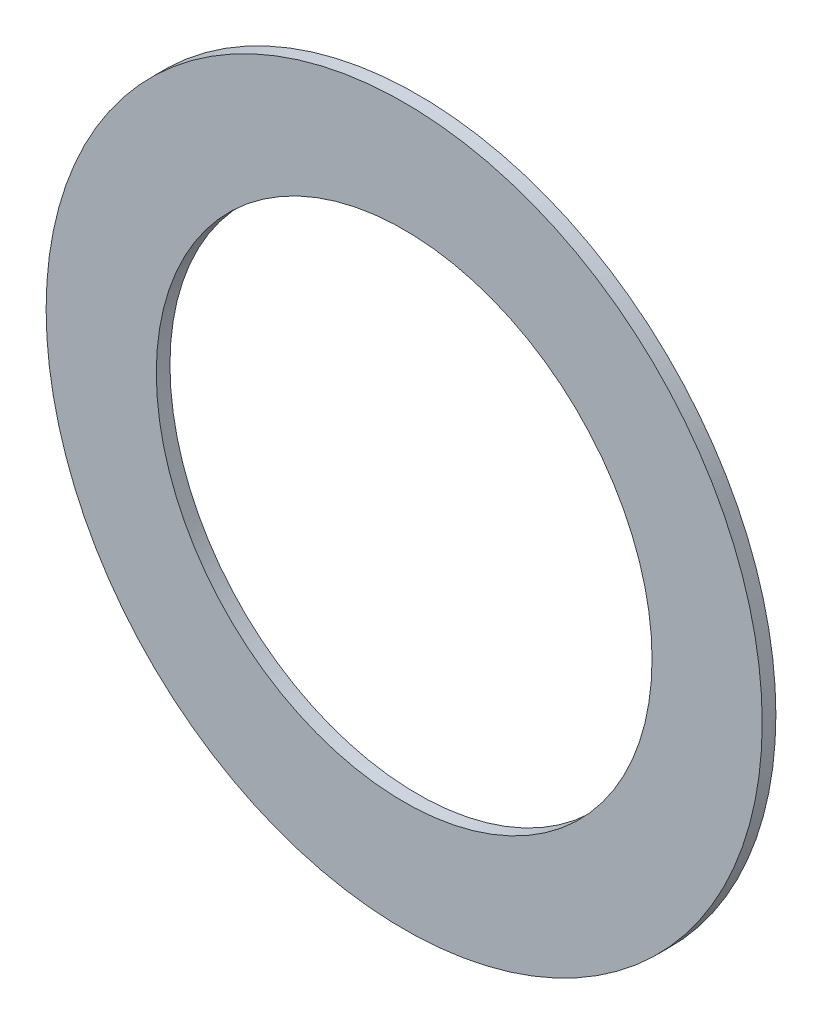
ISO-10303-21;
HEADER;
FILE_DESCRIPTION(('STEP AP214'),'2;1');
FILE_NAME('part.step','',(''),(''),'','','');
FILE_SCHEMA(('AUTOMOTIVE_DESIGN { 1 0 10303 214 1 1 1 1 }'));
ENDSEC;
DATA;
#1=APPLICATION_CONTEXT('core data for automotive mechanical design processes');
#2=APPLICATION_PROTOCOL_DEFINITION('international standard','automotive_design',2000,#1);
#3=PRODUCT_CONTEXT('',#1,'mechanical');
#4=PRODUCT('Part','Part','',(#3));
#5=PRODUCT_RELATED_PRODUCT_CATEGORY('part','',(#4));
#6=PRODUCT_DEFINITION_FORMATION('','',#4);
#7=PRODUCT_DEFINITION_CONTEXT('part definition',#1,'design');
#8=PRODUCT_DEFINITION('design','',#6,#7);
#9=PRODUCT_DEFINITION_SHAPE('','',#8);
#10=(LENGTH_UNIT() NAMED_UNIT(*) SI_UNIT(.MILLI.,.METRE.));
#11=(NAMED_UNIT(*) PLANE_ANGLE_UNIT() SI_UNIT($,.RADIAN.));
#12=(NAMED_UNIT(*) SI_UNIT($,.STERADIAN.) SOLID_ANGLE_UNIT());
#13=UNCERTAINTY_MEASURE_WITH_UNIT(LENGTH_MEASURE(1.E-05),#10,'distance_accuracy_value','');
#14=(GEOMETRIC_REPRESENTATION_CONTEXT(3) GLOBAL_UNCERTAINTY_ASSIGNED_CONTEXT((#13)) GLOBAL_UNIT_ASSIGNED_CONTEXT((#10,
#11,#12)) REPRESENTATION_CONTEXT('',''));
#15=CARTESIAN_POINT('',(0.,0.,0.));
#16=DIRECTION('',(0.,0.,1.));
#17=DIRECTION('',(1.,0.,0.));
#18=AXIS2_PLACEMENT_3D('',#15,#16,#17);
#19=CARTESIAN_POINT('',(-7.94024447736774,20.0165165193198,-0.7874));
#20=DIRECTION('',(0.,0.,-1.));
#21=DIRECTION('',(-1.,0.,0.));
#22=AXIS2_PLACEMENT_3D('',#19,#20,#21);
#23=PLANE('',#22);
#24=CARTESIAN_POINT('',(-7.94024447736774,20.0165165193198,-0.7874));
#25=DIRECTION('',(0.,0.,1.));
#26=DIRECTION('',(1.,0.,0.));
#27=AXIS2_PLACEMENT_3D('',#24,#25,#26);
#28=CIRCLE('',#27,20.6375);
#29=CARTESIAN_POINT('',(12.6972555226323,20.0165165193198,-0.7874));
#30=VERTEX_POINT('',#29);
#31=EDGE_CURVE('E26',#30,#30,#28,.T.);
#32=ORIENTED_EDGE('',*,*,#31,.F.);
#33=EDGE_LOOP('',(#32));
#34=FACE_BOUND('',#33,.T.);
#35=CARTESIAN_POINT('',(-7.94024447736774,20.0165165193198,-0.7874));
#36=DIRECTION('',(0.,0.,1.));
#37=DIRECTION('',(1.,0.,0.));
#38=AXIS2_PLACEMENT_3D('',#35,#36,#37);
#39=CIRCLE('',#38,14.2875);
#40=CARTESIAN_POINT('',(6.34725552263226,20.0165165193198,-0.7874));
#41=VERTEX_POINT('',#40);
#42=EDGE_CURVE('E17',#41,#41,#39,.T.);
#43=ORIENTED_EDGE('',*,*,#42,.T.);
#44=EDGE_LOOP('',(#43));
#45=FACE_BOUND('',#44,.T.);
#46=ADVANCED_FACE('F14',(#34,#45),#23,.T.);
#47=CARTESIAN_POINT('',(-7.94024447736774,20.0165165193198,-0.7874));
#48=DIRECTION('',(0.,0.,1.));
#49=DIRECTION('',(1.,0.,0.));
#50=AXIS2_PLACEMENT_3D('',#47,#48,#49);
#51=CYLINDRICAL_SURFACE('',#50,14.2875);
#52=ORIENTED_EDGE('',*,*,#42,.F.);
#53=EDGE_LOOP('',(#52));
#54=FACE_BOUND('',#53,.T.);
#55=CARTESIAN_POINT('',(-7.94024447736774,20.0165165193198,0.));
#56=DIRECTION('',(0.,0.,1.));
#57=DIRECTION('',(1.,0.,0.));
#58=AXIS2_PLACEMENT_3D('',#55,#56,#57);
#59=CIRCLE('',#58,14.2875);
#60=CARTESIAN_POINT('',(6.34725552263226,20.0165165193198,0.));
#61=VERTEX_POINT('',#60);
#62=EDGE_CURVE('E21',#61,#61,#59,.T.);
#63=ORIENTED_EDGE('',*,*,#62,.T.);
#64=EDGE_LOOP('',(#63));
#65=FACE_BOUND('',#64,.T.);
#66=ADVANCED_FACE('F35',(#54,#65),#51,.F.);
#67=CARTESIAN_POINT('',(-7.94024447736774,20.0165165193198,-0.7874));
#68=DIRECTION('',(0.,0.,1.));
#69=DIRECTION('',(1.,0.,0.));
#70=AXIS2_PLACEMENT_3D('',#67,#68,#69);
#71=CYLINDRICAL_SURFACE('',#70,20.6375);
#72=CARTESIAN_POINT('',(-7.94024447736774,20.0165165193198,0.));
#73=DIRECTION('',(0.,0.,1.));
#74=DIRECTION('',(1.,0.,0.));
#75=AXIS2_PLACEMENT_3D('',#72,#73,#74);
#76=CIRCLE('',#75,20.6375);
#77=CARTESIAN_POINT('',(12.6972555226323,20.0165165193198,0.));
#78=VERTEX_POINT('',#77);
#79=EDGE_CURVE('E9',#78,#78,#76,.F.);
#80=ORIENTED_EDGE('',*,*,#79,.T.);
#81=EDGE_LOOP('',(#80));
#82=FACE_BOUND('',#81,.T.);
#83=ORIENTED_EDGE('',*,*,#31,.T.);
#84=EDGE_LOOP('',(#83));
#85=FACE_BOUND('',#84,.T.);
#86=ADVANCED_FACE('F38',(#82,#85),#71,.T.);
#87=CARTESIAN_POINT('',(-7.94024447736774,20.0165165193198,0.));
#88=DIRECTION('',(0.,0.,-1.));
#89=DIRECTION('',(-1.,0.,0.));
#90=AXIS2_PLACEMENT_3D('',#87,#88,#89);
#91=PLANE('',#90);
#92=ORIENTED_EDGE('',*,*,#79,.F.);
#93=EDGE_LOOP('',(#92));
#94=FACE_BOUND('',#93,.T.);
#95=ORIENTED_EDGE('',*,*,#62,.F.);
#96=EDGE_LOOP('',(#95));
#97=FACE_BOUND('',#96,.T.);
#98=ADVANCED_FACE('F41',(#94,#97),#91,.F.);
#99=CLOSED_SHELL('',(#46,#66,#86,#98));
#100=MANIFOLD_SOLID_BREP('B1',#99);
#101=ADVANCED_BREP_SHAPE_REPRESENTATION('',(#18,#100),#14);
#102=SHAPE_DEFINITION_REPRESENTATION(#9,#101);
ENDSEC;
END-ISO-10303-21;
